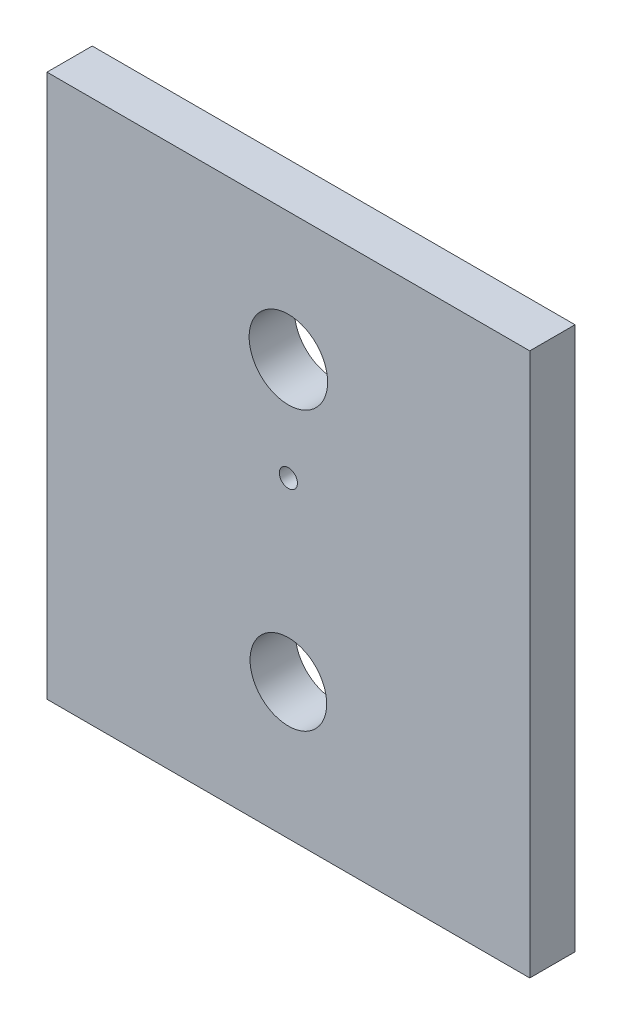
ISO-10303-21;
HEADER;
FILE_DESCRIPTION(('STEP AP214'),'2;1');
FILE_NAME('part.step','',(''),(''),'','','');
FILE_SCHEMA(('AUTOMOTIVE_DESIGN { 1 0 10303 214 1 1 1 1 }'));
ENDSEC;
DATA;
#1=APPLICATION_CONTEXT('core data for automotive mechanical design processes');
#2=APPLICATION_PROTOCOL_DEFINITION('international standard','automotive_design',2000,#1);
#3=PRODUCT_CONTEXT('',#1,'mechanical');
#4=PRODUCT('Part','Part','',(#3));
#5=PRODUCT_RELATED_PRODUCT_CATEGORY('part','',(#4));
#6=PRODUCT_DEFINITION_FORMATION('','',#4);
#7=PRODUCT_DEFINITION_CONTEXT('part definition',#1,'design');
#8=PRODUCT_DEFINITION('design','',#6,#7);
#9=PRODUCT_DEFINITION_SHAPE('','',#8);
#10=(LENGTH_UNIT() NAMED_UNIT(*) SI_UNIT(.MILLI.,.METRE.));
#11=(NAMED_UNIT(*) PLANE_ANGLE_UNIT() SI_UNIT($,.RADIAN.));
#12=(NAMED_UNIT(*) SI_UNIT($,.STERADIAN.) SOLID_ANGLE_UNIT());
#13=UNCERTAINTY_MEASURE_WITH_UNIT(LENGTH_MEASURE(1.E-05),#10,'distance_accuracy_value','');
#14=(GEOMETRIC_REPRESENTATION_CONTEXT(3) GLOBAL_UNCERTAINTY_ASSIGNED_CONTEXT((#13)) GLOBAL_UNIT_ASSIGNED_CONTEXT((#10,
#11,#12)) REPRESENTATION_CONTEXT('',''));
#15=CARTESIAN_POINT('',(0.,0.,0.));
#16=DIRECTION('',(0.,0.,1.));
#17=DIRECTION('',(1.,0.,0.));
#18=AXIS2_PLACEMENT_3D('',#15,#16,#17);
#19=CARTESIAN_POINT('',(80.,-95.,15.));
#20=DIRECTION('',(-1.,0.,0.));
#21=DIRECTION('',(0.,0.,1.));
#22=AXIS2_PLACEMENT_3D('',#19,#20,#21);
#23=PLANE('',#22);
#24=DIRECTION('',(0.,1.,0.));
#25=VECTOR('',#24,1.);
#26=CARTESIAN_POINT('',(80.,-95.,0.));
#27=LINE('',#26,#25);
#28=CARTESIAN_POINT('',(80.,-95.,0.));
#29=VERTEX_POINT('',#28);
#30=CARTESIAN_POINT('',(80.,85.,0.));
#31=VERTEX_POINT('',#30);
#32=EDGE_CURVE('E98',#29,#31,#27,.T.);
#33=ORIENTED_EDGE('',*,*,#32,.T.);
#34=DIRECTION('',(0.,0.,-1.));
#35=VECTOR('',#34,1.);
#36=CARTESIAN_POINT('',(80.,85.,15.));
#37=LINE('',#36,#35);
#38=CARTESIAN_POINT('',(80.,85.,15.));
#39=VERTEX_POINT('',#38);
#40=EDGE_CURVE('E11',#39,#31,#37,.T.);
#41=ORIENTED_EDGE('',*,*,#40,.F.);
#42=DIRECTION('',(0.,1.,0.));
#43=VECTOR('',#42,1.);
#44=CARTESIAN_POINT('',(80.,-95.,15.));
#45=LINE('',#44,#43);
#46=CARTESIAN_POINT('',(80.,-95.,15.));
#47=VERTEX_POINT('',#46);
#48=EDGE_CURVE('E85',#47,#39,#45,.T.);
#49=ORIENTED_EDGE('',*,*,#48,.F.);
#50=DIRECTION('',(0.,0.,-1.));
#51=VECTOR('',#50,1.);
#52=CARTESIAN_POINT('',(80.,-95.,15.));
#53=LINE('',#52,#51);
#54=EDGE_CURVE('E94',#47,#29,#53,.T.);
#55=ORIENTED_EDGE('',*,*,#54,.T.);
#56=EDGE_LOOP('',(#33,#41,#49,#55));
#57=FACE_BOUND('',#56,.T.);
#58=ADVANCED_FACE('F33',(#57),#23,.F.);
#59=CARTESIAN_POINT('',(-80.,85.,15.));
#60=DIRECTION('',(0.,-1.,0.));
#61=DIRECTION('',(0.,0.,-1.));
#62=AXIS2_PLACEMENT_3D('',#59,#60,#61);
#63=PLANE('',#62);
#64=DIRECTION('',(-1.,0.,0.));
#65=VECTOR('',#64,1.);
#66=CARTESIAN_POINT('',(-80.,85.,0.));
#67=LINE('',#66,#65);
#68=CARTESIAN_POINT('',(-80.,85.,0.));
#69=VERTEX_POINT('',#68);
#70=EDGE_CURVE('E89',#31,#69,#67,.T.);
#71=ORIENTED_EDGE('',*,*,#70,.T.);
#72=DIRECTION('',(0.,0.,-1.));
#73=VECTOR('',#72,1.);
#74=CARTESIAN_POINT('',(-80.,85.,15.));
#75=LINE('',#74,#73);
#76=CARTESIAN_POINT('',(-80.,85.,15.));
#77=VERTEX_POINT('',#76);
#78=EDGE_CURVE('E42',#77,#69,#75,.T.);
#79=ORIENTED_EDGE('',*,*,#78,.F.);
#80=DIRECTION('',(-1.,0.,0.));
#81=VECTOR('',#80,1.);
#82=CARTESIAN_POINT('',(-80.,85.,15.));
#83=LINE('',#82,#81);
#84=EDGE_CURVE('E80',#39,#77,#83,.T.);
#85=ORIENTED_EDGE('',*,*,#84,.F.);
#86=ORIENTED_EDGE('',*,*,#40,.T.);
#87=EDGE_LOOP('',(#71,#79,#85,#86));
#88=FACE_BOUND('',#87,.T.);
#89=ADVANCED_FACE('F88',(#88),#63,.F.);
#90=CARTESIAN_POINT('',(-80.,-95.,15.));
#91=DIRECTION('',(1.,0.,0.));
#92=DIRECTION('',(0.,0.,-1.));
#93=AXIS2_PLACEMENT_3D('',#90,#91,#92);
#94=PLANE('',#93);
#95=DIRECTION('',(0.,-1.,0.));
#96=VECTOR('',#95,1.);
#97=CARTESIAN_POINT('',(-80.,-95.,0.));
#98=LINE('',#97,#96);
#99=CARTESIAN_POINT('',(-80.,-95.,0.));
#100=VERTEX_POINT('',#99);
#101=EDGE_CURVE('E67',#69,#100,#98,.T.);
#102=ORIENTED_EDGE('',*,*,#101,.T.);
#103=DIRECTION('',(0.,0.,-1.));
#104=VECTOR('',#103,1.);
#105=CARTESIAN_POINT('',(-80.,-95.,15.));
#106=LINE('',#105,#104);
#107=CARTESIAN_POINT('',(-80.,-95.,15.));
#108=VERTEX_POINT('',#107);
#109=EDGE_CURVE('E90',#108,#100,#106,.T.);
#110=ORIENTED_EDGE('',*,*,#109,.F.);
#111=DIRECTION('',(0.,-1.,0.));
#112=VECTOR('',#111,1.);
#113=CARTESIAN_POINT('',(-80.,-95.,15.));
#114=LINE('',#113,#112);
#115=EDGE_CURVE('E83',#77,#108,#114,.T.);
#116=ORIENTED_EDGE('',*,*,#115,.F.);
#117=ORIENTED_EDGE('',*,*,#78,.T.);
#118=EDGE_LOOP('',(#102,#110,#116,#117));
#119=FACE_BOUND('',#118,.T.);
#120=ADVANCED_FACE('F92',(#119),#94,.F.);
#121=CARTESIAN_POINT('',(-80.,-95.,15.));
#122=DIRECTION('',(0.,1.,0.));
#123=DIRECTION('',(0.,0.,1.));
#124=AXIS2_PLACEMENT_3D('',#121,#122,#123);
#125=PLANE('',#124);
#126=DIRECTION('',(1.,0.,0.));
#127=VECTOR('',#126,1.);
#128=CARTESIAN_POINT('',(-80.,-95.,0.));
#129=LINE('',#128,#127);
#130=EDGE_CURVE('E73',#100,#29,#129,.T.);
#131=ORIENTED_EDGE('',*,*,#130,.T.);
#132=ORIENTED_EDGE('',*,*,#54,.F.);
#133=DIRECTION('',(1.,0.,0.));
#134=VECTOR('',#133,1.);
#135=CARTESIAN_POINT('',(-80.,-95.,15.));
#136=LINE('',#135,#134);
#137=EDGE_CURVE('E50',#108,#47,#136,.T.);
#138=ORIENTED_EDGE('',*,*,#137,.F.);
#139=ORIENTED_EDGE('',*,*,#109,.T.);
#140=EDGE_LOOP('',(#131,#132,#138,#139));
#141=FACE_BOUND('',#140,.T.);
#142=ADVANCED_FACE('F106',(#141),#125,.F.);
#143=CARTESIAN_POINT('',(0.,0.,15.));
#144=DIRECTION('',(0.,0.,-1.));
#145=DIRECTION('',(-1.,0.,0.));
#146=AXIS2_PLACEMENT_3D('',#143,#144,#145);
#147=PLANE('',#146);
#148=CARTESIAN_POINT('',(0.,-50.,15.));
#149=DIRECTION('',(0.,0.,1.));
#150=DIRECTION('',(1.,0.,0.));
#151=AXIS2_PLACEMENT_3D('',#148,#149,#150);
#152=CIRCLE('',#151,12.7);
#153=CARTESIAN_POINT('',(12.7000000000001,-50.,15.));
#154=VERTEX_POINT('',#153);
#155=EDGE_CURVE('E121',#154,#154,#152,.T.);
#156=ORIENTED_EDGE('',*,*,#155,.F.);
#157=EDGE_LOOP('',(#156));
#158=FACE_BOUND('',#157,.T.);
#159=CARTESIAN_POINT('',(0.,8.5,15.));
#160=DIRECTION('',(0.,0.,1.));
#161=DIRECTION('',(1.,0.,0.));
#162=AXIS2_PLACEMENT_3D('',#159,#160,#161);
#163=CIRCLE('',#162,3.);
#164=CARTESIAN_POINT('',(3.,8.5,15.));
#165=VERTEX_POINT('',#164);
#166=EDGE_CURVE('E117',#165,#165,#163,.T.);
#167=ORIENTED_EDGE('',*,*,#166,.F.);
#168=EDGE_LOOP('',(#167));
#169=FACE_BOUND('',#168,.T.);
#170=CARTESIAN_POINT('',(0.,42.5,15.));
#171=DIRECTION('',(0.,0.,1.));
#172=DIRECTION('',(1.,0.,0.));
#173=AXIS2_PLACEMENT_3D('',#170,#171,#172);
#174=CIRCLE('',#173,13.005);
#175=CARTESIAN_POINT('',(13.005,42.5,15.));
#176=VERTEX_POINT('',#175);
#177=EDGE_CURVE('E114',#176,#176,#174,.T.);
#178=ORIENTED_EDGE('',*,*,#177,.F.);
#179=EDGE_LOOP('',(#178));
#180=FACE_BOUND('',#179,.T.);
#181=ORIENTED_EDGE('',*,*,#48,.T.);
#182=ORIENTED_EDGE('',*,*,#84,.T.);
#183=ORIENTED_EDGE('',*,*,#115,.T.);
#184=ORIENTED_EDGE('',*,*,#137,.T.);
#185=EDGE_LOOP('',(#181,#182,#183,#184));
#186=FACE_BOUND('',#185,.T.);
#187=ADVANCED_FACE('F81',(#158,#169,#180,#186),#147,.F.);
#188=CARTESIAN_POINT('',(0.,0.,0.));
#189=DIRECTION('',(0.,0.,-1.));
#190=DIRECTION('',(-1.,0.,0.));
#191=AXIS2_PLACEMENT_3D('',#188,#189,#190);
#192=PLANE('',#191);
#193=CARTESIAN_POINT('',(0.,-50.,0.));
#194=DIRECTION('',(0.,0.,1.));
#195=DIRECTION('',(1.,0.,0.));
#196=AXIS2_PLACEMENT_3D('',#193,#194,#195);
#197=CIRCLE('',#196,12.7);
#198=CARTESIAN_POINT('',(12.7000000000001,-50.,0.));
#199=VERTEX_POINT('',#198);
#200=EDGE_CURVE('E120',#199,#199,#197,.T.);
#201=ORIENTED_EDGE('',*,*,#200,.T.);
#202=EDGE_LOOP('',(#201));
#203=FACE_BOUND('',#202,.T.);
#204=CARTESIAN_POINT('',(0.,8.5,0.));
#205=DIRECTION('',(0.,0.,-1.));
#206=DIRECTION('',(-1.,0.,0.));
#207=AXIS2_PLACEMENT_3D('',#204,#205,#206);
#208=CIRCLE('',#207,2.99999999999999);
#209=CARTESIAN_POINT('',(-2.99999999999999,8.5,0.));
#210=VERTEX_POINT('',#209);
#211=EDGE_CURVE('E36',#210,#210,#208,.T.);
#212=ORIENTED_EDGE('',*,*,#211,.F.);
#213=EDGE_LOOP('',(#212));
#214=FACE_BOUND('',#213,.T.);
#215=CARTESIAN_POINT('',(0.,42.5,0.));
#216=DIRECTION('',(0.,0.,1.));
#217=DIRECTION('',(1.,0.,0.));
#218=AXIS2_PLACEMENT_3D('',#215,#216,#217);
#219=CIRCLE('',#218,13.005);
#220=CARTESIAN_POINT('',(13.005,42.5,0.));
#221=VERTEX_POINT('',#220);
#222=EDGE_CURVE('E101',#221,#221,#219,.T.);
#223=ORIENTED_EDGE('',*,*,#222,.T.);
#224=EDGE_LOOP('',(#223));
#225=FACE_BOUND('',#224,.T.);
#226=ORIENTED_EDGE('',*,*,#32,.F.);
#227=ORIENTED_EDGE('',*,*,#130,.F.);
#228=ORIENTED_EDGE('',*,*,#101,.F.);
#229=ORIENTED_EDGE('',*,*,#70,.F.);
#230=EDGE_LOOP('',(#226,#227,#228,#229));
#231=FACE_BOUND('',#230,.T.);
#232=ADVANCED_FACE('F109',(#203,#214,#225,#231),#192,.T.);
#233=CARTESIAN_POINT('',(0.,42.5,15.));
#234=DIRECTION('',(0.,0.,1.));
#235=DIRECTION('',(1.,0.,0.));
#236=AXIS2_PLACEMENT_3D('',#233,#234,#235);
#237=CYLINDRICAL_SURFACE('',#236,13.005);
#238=ORIENTED_EDGE('',*,*,#222,.F.);
#239=EDGE_LOOP('',(#238));
#240=FACE_BOUND('',#239,.T.);
#241=ORIENTED_EDGE('',*,*,#177,.T.);
#242=EDGE_LOOP('',(#241));
#243=FACE_BOUND('',#242,.T.);
#244=ADVANCED_FACE('F143',(#240,#243),#237,.F.);
#245=CARTESIAN_POINT('',(0.,8.5,15.));
#246=DIRECTION('',(0.,0.,1.));
#247=DIRECTION('',(1.,0.,0.));
#248=AXIS2_PLACEMENT_3D('',#245,#246,#247);
#249=CYLINDRICAL_SURFACE('',#248,2.99999999999999);
#250=ORIENTED_EDGE('',*,*,#211,.T.);
#251=EDGE_LOOP('',(#250));
#252=FACE_BOUND('',#251,.T.);
#253=ORIENTED_EDGE('',*,*,#166,.T.);
#254=EDGE_LOOP('',(#253));
#255=FACE_BOUND('',#254,.T.);
#256=ADVANCED_FACE('F132',(#252,#255),#249,.F.);
#257=CARTESIAN_POINT('',(0.,-50.,0.));
#258=DIRECTION('',(0.,0.,1.));
#259=DIRECTION('',(1.,0.,0.));
#260=AXIS2_PLACEMENT_3D('',#257,#258,#259);
#261=CYLINDRICAL_SURFACE('',#260,12.7);
#262=ORIENTED_EDGE('',*,*,#200,.F.);
#263=EDGE_LOOP('',(#262));
#264=FACE_BOUND('',#263,.T.);
#265=ORIENTED_EDGE('',*,*,#155,.T.);
#266=EDGE_LOOP('',(#265));
#267=FACE_BOUND('',#266,.T.);
#268=ADVANCED_FACE('F129',(#264,#267),#261,.F.);
#269=CLOSED_SHELL('',(#58,#89,#120,#142,#187,#232,#244,#256,#268));
#270=MANIFOLD_SOLID_BREP('B2',#269);
#271=ADVANCED_BREP_SHAPE_REPRESENTATION('',(#18,#270),#14);
#272=SHAPE_DEFINITION_REPRESENTATION(#9,#271);
ENDSEC;
END-ISO-10303-21;
